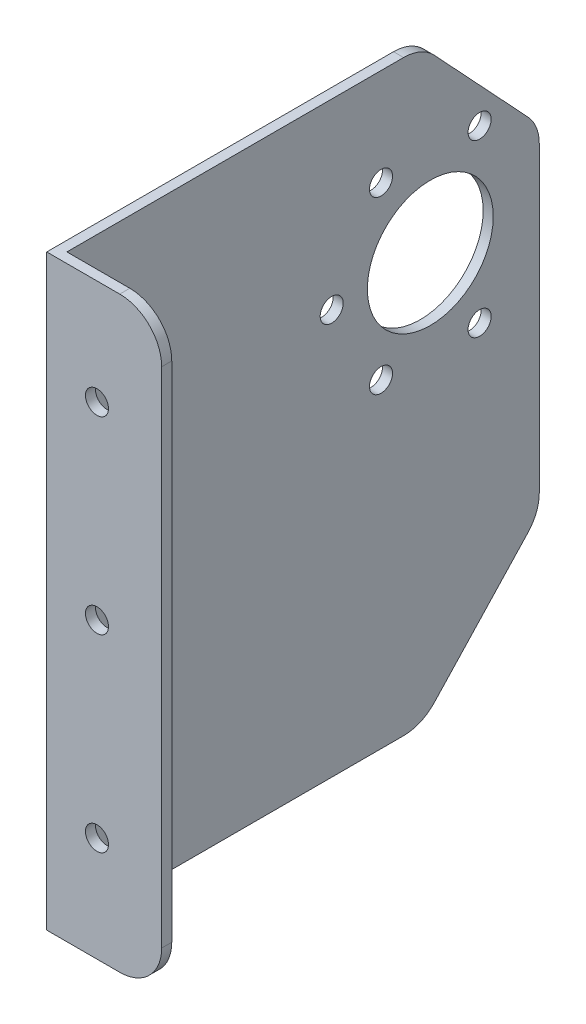
ISO-10303-21;
HEADER;
FILE_DESCRIPTION(('STEP AP214'),'2;1');
FILE_NAME('part.step','',(''),(''),'','','');
FILE_SCHEMA(('AUTOMOTIVE_DESIGN { 1 0 10303 214 1 1 1 1 }'));
ENDSEC;
DATA;
#1=APPLICATION_CONTEXT('core data for automotive mechanical design processes');
#2=APPLICATION_PROTOCOL_DEFINITION('international standard','automotive_design',2000,#1);
#3=PRODUCT_CONTEXT('',#1,'mechanical');
#4=PRODUCT('Part','Part','',(#3));
#5=PRODUCT_RELATED_PRODUCT_CATEGORY('part','',(#4));
#6=PRODUCT_DEFINITION_FORMATION('','',#4);
#7=PRODUCT_DEFINITION_CONTEXT('part definition',#1,'design');
#8=PRODUCT_DEFINITION('design','',#6,#7);
#9=PRODUCT_DEFINITION_SHAPE('','',#8);
#10=(LENGTH_UNIT() NAMED_UNIT(*) SI_UNIT(.MILLI.,.METRE.));
#11=(NAMED_UNIT(*) PLANE_ANGLE_UNIT() SI_UNIT($,.RADIAN.));
#12=(NAMED_UNIT(*) SI_UNIT($,.STERADIAN.) SOLID_ANGLE_UNIT());
#13=UNCERTAINTY_MEASURE_WITH_UNIT(LENGTH_MEASURE(1.E-05),#10,'distance_accuracy_value','');
#14=(GEOMETRIC_REPRESENTATION_CONTEXT(3) GLOBAL_UNCERTAINTY_ASSIGNED_CONTEXT((#13)) GLOBAL_UNIT_ASSIGNED_CONTEXT((#10,
#11,#12)) REPRESENTATION_CONTEXT('',''));
#15=CARTESIAN_POINT('',(0.,0.,0.));
#16=DIRECTION('',(0.,0.,1.));
#17=DIRECTION('',(1.,0.,0.));
#18=AXIS2_PLACEMENT_3D('',#15,#16,#17);
#19=CARTESIAN_POINT('',(2.4,0.,0.));
#20=DIRECTION('',(0.,0.,-1.));
#21=DIRECTION('',(0.,1.,0.));
#22=AXIS2_PLACEMENT_3D('',#19,#20,#21);
#23=PLANE('',#22);
#24=CARTESIAN_POINT('',(11.9749835807568,-115.,0.));
#25=DIRECTION('',(0.,0.,1.));
#26=DIRECTION('',(1.,0.,0.));
#27=AXIS2_PLACEMENT_3D('',#24,#25,#26);
#28=CIRCLE('',#27,2.75);
#29=CARTESIAN_POINT('',(14.7249835807568,-115.,0.));
#30=VERTEX_POINT('',#29);
#31=EDGE_CURVE('E572',#30,#30,#28,.T.);
#32=ORIENTED_EDGE('',*,*,#31,.F.);
#33=EDGE_LOOP('',(#32));
#34=FACE_BOUND('',#33,.T.);
#35=CARTESIAN_POINT('',(11.9749835807568,-25.,0.));
#36=DIRECTION('',(0.,0.,1.));
#37=DIRECTION('',(1.,0.,0.));
#38=AXIS2_PLACEMENT_3D('',#35,#36,#37);
#39=CIRCLE('',#38,2.75);
#40=CARTESIAN_POINT('',(14.7249835807568,-25.,0.));
#41=VERTEX_POINT('',#40);
#42=EDGE_CURVE('E573',#41,#41,#39,.T.);
#43=ORIENTED_EDGE('',*,*,#42,.F.);
#44=EDGE_LOOP('',(#43));
#45=FACE_BOUND('',#44,.T.);
#46=CARTESIAN_POINT('',(11.9749835807568,-70.,0.));
#47=DIRECTION('',(0.,0.,1.));
#48=DIRECTION('',(1.,0.,0.));
#49=AXIS2_PLACEMENT_3D('',#46,#47,#48);
#50=CIRCLE('',#49,2.75);
#51=CARTESIAN_POINT('',(14.7249835807568,-70.,0.));
#52=VERTEX_POINT('',#51);
#53=EDGE_CURVE('E258',#52,#52,#50,.T.);
#54=ORIENTED_EDGE('',*,*,#53,.F.);
#55=EDGE_LOOP('',(#54));
#56=FACE_BOUND('',#55,.T.);
#57=DIRECTION('',(-1.,0.,0.));
#58=VECTOR('',#57,1.);
#59=CARTESIAN_POINT('',(2.4,-140.,0.));
#60=LINE('',#59,#58);
#61=CARTESIAN_POINT('',(17.4,-140.,0.));
#62=VERTEX_POINT('',#61);
#63=CARTESIAN_POINT('',(0.,-140.,0.));
#64=VERTEX_POINT('',#63);
#65=EDGE_CURVE('E204',#62,#64,#60,.T.);
#66=ORIENTED_EDGE('',*,*,#65,.F.);
#67=CARTESIAN_POINT('',(17.4,-130.,0.));
#68=DIRECTION('',(0.,0.,-1.));
#69=DIRECTION('',(0.,1.,0.));
#70=AXIS2_PLACEMENT_3D('',#67,#68,#69);
#71=CIRCLE('',#70,10.);
#72=CARTESIAN_POINT('',(27.4,-130.,0.));
#73=VERTEX_POINT('',#72);
#74=EDGE_CURVE('E48',#62,#73,#71,.F.);
#75=ORIENTED_EDGE('',*,*,#74,.T.);
#76=DIRECTION('',(0.,-1.,0.));
#77=VECTOR('',#76,1.);
#78=CARTESIAN_POINT('',(27.4,-140.,0.));
#79=LINE('',#78,#77);
#80=CARTESIAN_POINT('',(27.4,-10.,0.));
#81=VERTEX_POINT('',#80);
#82=EDGE_CURVE('E167',#81,#73,#79,.T.);
#83=ORIENTED_EDGE('',*,*,#82,.F.);
#84=CARTESIAN_POINT('',(17.4,-10.,0.));
#85=DIRECTION('',(0.,0.,-1.));
#86=DIRECTION('',(0.,1.,0.));
#87=AXIS2_PLACEMENT_3D('',#84,#85,#86);
#88=CIRCLE('',#87,10.);
#89=CARTESIAN_POINT('',(17.4,0.,0.));
#90=VERTEX_POINT('',#89);
#91=EDGE_CURVE('E57',#81,#90,#88,.F.);
#92=ORIENTED_EDGE('',*,*,#91,.T.);
#93=DIRECTION('',(-1.,0.,0.));
#94=VECTOR('',#93,1.);
#95=CARTESIAN_POINT('',(2.4,0.,0.));
#96=LINE('',#95,#94);
#97=CARTESIAN_POINT('',(0.,0.,0.));
#98=VERTEX_POINT('',#97);
#99=EDGE_CURVE('E161',#90,#98,#96,.T.);
#100=ORIENTED_EDGE('',*,*,#99,.T.);
#101=DIRECTION('',(0.,-1.,0.));
#102=VECTOR('',#101,1.);
#103=CARTESIAN_POINT('',(0.,0.,0.));
#104=LINE('',#103,#102);
#105=EDGE_CURVE('E177',#98,#64,#104,.T.);
#106=ORIENTED_EDGE('',*,*,#105,.T.);
#107=EDGE_LOOP('',(#66,#75,#83,#92,#100,#106));
#108=FACE_BOUND('',#107,.T.);
#109=ADVANCED_FACE('F39',(#34,#45,#56,#108),#23,.F.);
#110=CARTESIAN_POINT('',(2.4,-140.,0.));
#111=DIRECTION('',(0.,1.,0.));
#112=DIRECTION('',(0.,0.,1.));
#113=AXIS2_PLACEMENT_3D('',#110,#111,#112);
#114=PLANE('',#113);
#115=DIRECTION('',(-1.,0.,0.));
#116=VECTOR('',#115,1.);
#117=CARTESIAN_POINT('',(27.4,-140.,-2.4));
#118=LINE('',#117,#116);
#119=CARTESIAN_POINT('',(17.4,-140.,-2.4));
#120=VERTEX_POINT('',#119);
#121=CARTESIAN_POINT('',(2.4,-140.,-2.4));
#122=VERTEX_POINT('',#121);
#123=EDGE_CURVE('E151',#120,#122,#118,.T.);
#124=ORIENTED_EDGE('',*,*,#123,.F.);
#125=DIRECTION('',(0.,0.,-1.));
#126=VECTOR('',#125,1.);
#127=CARTESIAN_POINT('',(17.4,-140.,0.));
#128=LINE('',#127,#126);
#129=EDGE_CURVE('E63',#120,#62,#128,.F.);
#130=ORIENTED_EDGE('',*,*,#129,.T.);
#131=ORIENTED_EDGE('',*,*,#65,.T.);
#132=DIRECTION('',(0.,0.,-1.));
#133=VECTOR('',#132,1.);
#134=CARTESIAN_POINT('',(0.,-140.,0.));
#135=LINE('',#134,#133);
#136=CARTESIAN_POINT('',(0.,-140.,-82.6544769808779));
#137=VERTEX_POINT('',#136);
#138=EDGE_CURVE('E194',#64,#137,#135,.T.);
#139=ORIENTED_EDGE('',*,*,#138,.T.);
#140=DIRECTION('',(1.,0.,0.));
#141=VECTOR('',#140,1.);
#142=CARTESIAN_POINT('',(2.4,-140.,-82.6544769808779));
#143=LINE('',#142,#141);
#144=CARTESIAN_POINT('',(2.4,-140.,-82.6544769808779));
#145=VERTEX_POINT('',#144);
#146=EDGE_CURVE('E206',#137,#145,#143,.T.);
#147=ORIENTED_EDGE('',*,*,#146,.T.);
#148=DIRECTION('',(0.,0.,-1.));
#149=VECTOR('',#148,1.);
#150=CARTESIAN_POINT('',(2.4,-140.,0.));
#151=LINE('',#150,#149);
#152=EDGE_CURVE('E189',#122,#145,#151,.T.);
#153=ORIENTED_EDGE('',*,*,#152,.F.);
#154=EDGE_LOOP('',(#124,#130,#131,#139,#147,#153));
#155=FACE_BOUND('',#154,.T.);
#156=ADVANCED_FACE('F278',(#155),#114,.F.);
#157=CARTESIAN_POINT('',(2.4,0.,-115.));
#158=DIRECTION('',(0.,0.,1.));
#159=DIRECTION('',(0.,-1.,0.));
#160=AXIS2_PLACEMENT_3D('',#157,#158,#159);
#161=PLANE('',#160);
#162=DIRECTION('',(0.,1.,0.));
#163=VECTOR('',#162,1.);
#164=CARTESIAN_POINT('',(2.4,0.,-115.));
#165=LINE('',#164,#163);
#166=CARTESIAN_POINT('',(2.4,-106.058368193798,-115.));
#167=VERTEX_POINT('',#166);
#168=CARTESIAN_POINT('',(2.4,-33.9416318062023,-115.));
#169=VERTEX_POINT('',#168);
#170=EDGE_CURVE('E165',#167,#169,#165,.T.);
#171=ORIENTED_EDGE('',*,*,#170,.F.);
#172=DIRECTION('',(1.,0.,0.));
#173=VECTOR('',#172,1.);
#174=CARTESIAN_POINT('',(2.4,-106.058368193798,-115.));
#175=LINE('',#174,#173);
#176=CARTESIAN_POINT('',(0.,-106.058368193798,-115.));
#177=VERTEX_POINT('',#176);
#178=EDGE_CURVE('E235',#167,#177,#175,.F.);
#179=ORIENTED_EDGE('',*,*,#178,.T.);
#180=DIRECTION('',(0.,1.,0.));
#181=VECTOR('',#180,1.);
#182=CARTESIAN_POINT('',(0.,0.,-115.));
#183=LINE('',#182,#181);
#184=CARTESIAN_POINT('',(0.,-33.9416318062023,-115.));
#185=VERTEX_POINT('',#184);
#186=EDGE_CURVE('E196',#177,#185,#183,.T.);
#187=ORIENTED_EDGE('',*,*,#186,.T.);
#188=DIRECTION('',(1.,0.,0.));
#189=VECTOR('',#188,1.);
#190=CARTESIAN_POINT('',(2.4,-33.9416318062023,-115.));
#191=LINE('',#190,#189);
#192=EDGE_CURVE('E228',#185,#169,#191,.T.);
#193=ORIENTED_EDGE('',*,*,#192,.T.);
#194=EDGE_LOOP('',(#171,#179,#187,#193));
#195=FACE_BOUND('',#194,.T.);
#196=ADVANCED_FACE('F288',(#195),#161,.F.);
#197=CARTESIAN_POINT('',(2.4,0.,0.));
#198=DIRECTION('',(0.,-1.,0.));
#199=DIRECTION('',(0.,0.,-1.));
#200=AXIS2_PLACEMENT_3D('',#197,#198,#199);
#201=PLANE('',#200);
#202=ORIENTED_EDGE('',*,*,#99,.F.);
#203=DIRECTION('',(0.,0.,1.));
#204=VECTOR('',#203,1.);
#205=CARTESIAN_POINT('',(17.4,0.,0.));
#206=LINE('',#205,#204);
#207=CARTESIAN_POINT('',(17.4,0.,-2.4));
#208=VERTEX_POINT('',#207);
#209=EDGE_CURVE('E11',#90,#208,#206,.F.);
#210=ORIENTED_EDGE('',*,*,#209,.T.);
#211=DIRECTION('',(-1.,0.,0.));
#212=VECTOR('',#211,1.);
#213=CARTESIAN_POINT('',(27.4,0.,-2.4));
#214=LINE('',#213,#212);
#215=CARTESIAN_POINT('',(2.4,0.,-2.4));
#216=VERTEX_POINT('',#215);
#217=EDGE_CURVE('E142',#208,#216,#214,.T.);
#218=ORIENTED_EDGE('',*,*,#217,.T.);
#219=DIRECTION('',(0.,0.,1.));
#220=VECTOR('',#219,1.);
#221=CARTESIAN_POINT('',(2.4,0.,0.));
#222=LINE('',#221,#220);
#223=CARTESIAN_POINT('',(2.4,0.,-82.6544769808779));
#224=VERTEX_POINT('',#223);
#225=EDGE_CURVE('E144',#224,#216,#222,.T.);
#226=ORIENTED_EDGE('',*,*,#225,.F.);
#227=DIRECTION('',(1.,0.,0.));
#228=VECTOR('',#227,1.);
#229=CARTESIAN_POINT('',(2.4,0.,-82.6544769808779));
#230=LINE('',#229,#228);
#231=CARTESIAN_POINT('',(0.,0.,-82.6544769808779));
#232=VERTEX_POINT('',#231);
#233=EDGE_CURVE('E239',#224,#232,#230,.F.);
#234=ORIENTED_EDGE('',*,*,#233,.T.);
#235=DIRECTION('',(0.,0.,1.));
#236=VECTOR('',#235,1.);
#237=CARTESIAN_POINT('',(0.,0.,0.));
#238=LINE('',#237,#236);
#239=EDGE_CURVE('E190',#232,#98,#238,.T.);
#240=ORIENTED_EDGE('',*,*,#239,.T.);
#241=EDGE_LOOP('',(#202,#210,#218,#226,#234,#240));
#242=FACE_BOUND('',#241,.T.);
#243=ADVANCED_FACE('F145',(#242),#201,.F.);
#244=CARTESIAN_POINT('',(2.4,0.,0.));
#245=DIRECTION('',(1.,0.,0.));
#246=DIRECTION('',(0.,0.,-1.));
#247=AXIS2_PLACEMENT_3D('',#244,#245,#246);
#248=PLANE('',#247);
#249=CARTESIAN_POINT('',(2.4,-23.1543738118279,-77.277947803544));
#250=DIRECTION('',(1.,0.,0.));
#251=DIRECTION('',(0.,0.,-1.));
#252=AXIS2_PLACEMENT_3D('',#249,#250,#251);
#253=CIRCLE('',#252,2.75);
#254=CARTESIAN_POINT('',(2.4,-23.1543738118279,-80.027947803544));
#255=VERTEX_POINT('',#254);
#256=EDGE_CURVE('E541',#255,#255,#253,.T.);
#257=ORIENTED_EDGE('',*,*,#256,.F.);
#258=EDGE_LOOP('',(#257));
#259=FACE_BOUND('',#258,.T.);
#260=CARTESIAN_POINT('',(2.4,-23.1543738118279,-100.777947803544));
#261=DIRECTION('',(1.,0.,0.));
#262=DIRECTION('',(0.,0.,-1.));
#263=AXIS2_PLACEMENT_3D('',#260,#261,#262);
#264=CIRCLE('',#263,2.75000000000001);
#265=CARTESIAN_POINT('',(2.4,-23.1543738118279,-103.527947803544));
#266=VERTEX_POINT('',#265);
#267=EDGE_CURVE('E550',#266,#266,#264,.T.);
#268=ORIENTED_EDGE('',*,*,#267,.F.);
#269=EDGE_LOOP('',(#268));
#270=FACE_BOUND('',#269,.T.);
#271=CARTESIAN_POINT('',(2.4,-43.5059708007622,-65.527947803544));
#272=DIRECTION('',(1.,0.,0.));
#273=DIRECTION('',(0.,0.,-1.));
#274=AXIS2_PLACEMENT_3D('',#271,#272,#273);
#275=CIRCLE('',#274,2.74999999999999);
#276=CARTESIAN_POINT('',(2.4,-43.5059708007622,-68.277947803544));
#277=VERTEX_POINT('',#276);
#278=EDGE_CURVE('E559',#277,#277,#275,.T.);
#279=ORIENTED_EDGE('',*,*,#278,.F.);
#280=EDGE_LOOP('',(#279));
#281=FACE_BOUND('',#280,.T.);
#282=CARTESIAN_POINT('',(2.4,-63.8575677896965,-77.2779478035441));
#283=DIRECTION('',(1.,0.,0.));
#284=DIRECTION('',(0.,0.,-1.));
#285=AXIS2_PLACEMENT_3D('',#282,#283,#284);
#286=CIRCLE('',#285,2.75000000000001);
#287=CARTESIAN_POINT('',(2.4,-63.8575677896965,-80.0279478035441));
#288=VERTEX_POINT('',#287);
#289=EDGE_CURVE('E562',#288,#288,#286,.T.);
#290=ORIENTED_EDGE('',*,*,#289,.F.);
#291=EDGE_LOOP('',(#290));
#292=FACE_BOUND('',#291,.T.);
#293=CARTESIAN_POINT('',(2.4,-63.8575677896965,-100.777947803544));
#294=DIRECTION('',(1.,0.,0.));
#295=DIRECTION('',(0.,0.,-1.));
#296=AXIS2_PLACEMENT_3D('',#293,#294,#295);
#297=CIRCLE('',#296,2.75);
#298=CARTESIAN_POINT('',(2.4,-63.8575677896965,-103.527947803544));
#299=VERTEX_POINT('',#298);
#300=EDGE_CURVE('E568',#299,#299,#297,.T.);
#301=ORIENTED_EDGE('',*,*,#300,.F.);
#302=EDGE_LOOP('',(#301));
#303=FACE_BOUND('',#302,.T.);
#304=CARTESIAN_POINT('',(2.4,-43.5059708007621,-89.0279478035438));
#305=DIRECTION('',(1.,0.,0.));
#306=DIRECTION('',(0.,0.,-1.));
#307=AXIS2_PLACEMENT_3D('',#304,#305,#306);
#308=CIRCLE('',#307,15.);
#309=CARTESIAN_POINT('',(2.4,-43.5059708007621,-104.027947803544));
#310=VERTEX_POINT('',#309);
#311=EDGE_CURVE('E545',#310,#310,#308,.T.);
#312=ORIENTED_EDGE('',*,*,#311,.F.);
#313=EDGE_LOOP('',(#312));
#314=FACE_BOUND('',#313,.T.);
#315=DIRECTION('',(0.,1.,0.));
#316=VECTOR('',#315,1.);
#317=CARTESIAN_POINT('',(2.4,-140.,-2.4));
#318=LINE('',#317,#316);
#319=EDGE_CURVE('E160',#122,#216,#318,.T.);
#320=ORIENTED_EDGE('',*,*,#319,.F.);
#321=ORIENTED_EDGE('',*,*,#152,.T.);
#322=CARTESIAN_POINT('',(2.4,-130.,-82.6544769808779));
#323=DIRECTION('',(1.,0.,0.));
#324=DIRECTION('',(0.,0.,-1.));
#325=AXIS2_PLACEMENT_3D('',#322,#323,#324);
#326=CIRCLE('',#325,10.);
#327=CARTESIAN_POINT('',(2.4,-136.8231825036,-89.9650296633066));
#328=VERTEX_POINT('',#327);
#329=EDGE_CURVE('E212',#145,#328,#326,.T.);
#330=ORIENTED_EDGE('',*,*,#329,.T.);
#331=DIRECTION('',(0.,-0.731055268242869,0.682318250360011));
#332=VECTOR('',#331,1.);
#333=CARTESIAN_POINT('',(2.4,-110.,-115.));
#334=LINE('',#333,#332);
#335=CARTESIAN_POINT('',(2.4,-112.881550697398,-112.310552682429));
#336=VERTEX_POINT('',#335);
#337=EDGE_CURVE('E181',#336,#328,#334,.T.);
#338=ORIENTED_EDGE('',*,*,#337,.F.);
#339=CARTESIAN_POINT('',(2.4,-106.058368193798,-105.));
#340=DIRECTION('',(1.,0.,0.));
#341=DIRECTION('',(0.,0.,-1.));
#342=AXIS2_PLACEMENT_3D('',#339,#340,#341);
#343=CIRCLE('',#342,10.);
#344=EDGE_CURVE('E215',#336,#167,#343,.T.);
#345=ORIENTED_EDGE('',*,*,#344,.T.);
#346=ORIENTED_EDGE('',*,*,#170,.T.);
#347=CARTESIAN_POINT('',(2.4,-33.9416318062023,-105.));
#348=DIRECTION('',(1.,0.,0.));
#349=DIRECTION('',(0.,0.,-1.));
#350=AXIS2_PLACEMENT_3D('',#347,#348,#349);
#351=CIRCLE('',#350,10.);
#352=CARTESIAN_POINT('',(2.4,-27.1184493026022,-112.310552682429));
#353=VERTEX_POINT('',#352);
#354=EDGE_CURVE('E209',#169,#353,#351,.T.);
#355=ORIENTED_EDGE('',*,*,#354,.T.);
#356=DIRECTION('',(0.,-0.731055268242869,-0.682318250360012));
#357=VECTOR('',#356,1.);
#358=CARTESIAN_POINT('',(2.4,0.,-87.));
#359=LINE('',#358,#357);
#360=CARTESIAN_POINT('',(2.4,-3.17681749639988,-89.9650296633066));
#361=VERTEX_POINT('',#360);
#362=EDGE_CURVE('E179',#361,#353,#359,.T.);
#363=ORIENTED_EDGE('',*,*,#362,.F.);
#364=CARTESIAN_POINT('',(2.4,-10.,-82.6544769808779));
#365=DIRECTION('',(1.,0.,0.));
#366=DIRECTION('',(0.,0.,-1.));
#367=AXIS2_PLACEMENT_3D('',#364,#365,#366);
#368=CIRCLE('',#367,10.);
#369=EDGE_CURVE('E159',#361,#224,#368,.T.);
#370=ORIENTED_EDGE('',*,*,#369,.T.);
#371=ORIENTED_EDGE('',*,*,#225,.T.);
#372=EDGE_LOOP('',(#320,#321,#330,#338,#345,#346,#355,#363,#370,#371));
#373=FACE_BOUND('',#372,.T.);
#374=ADVANCED_FACE('F156',(#259,#270,#281,#292,#303,#314,#373),#248,.T.);
#375=CARTESIAN_POINT('',(0.,0.,0.));
#376=DIRECTION('',(1.,0.,0.));
#377=DIRECTION('',(0.,0.,-1.));
#378=AXIS2_PLACEMENT_3D('',#375,#376,#377);
#379=PLANE('',#378);
#380=CARTESIAN_POINT('',(0.,-23.1543738118279,-77.277947803544));
#381=DIRECTION('',(1.,0.,0.));
#382=DIRECTION('',(0.,0.,-1.));
#383=AXIS2_PLACEMENT_3D('',#380,#381,#382);
#384=CIRCLE('',#383,2.75);
#385=CARTESIAN_POINT('',(0.,-23.1543738118279,-80.027947803544));
#386=VERTEX_POINT('',#385);
#387=EDGE_CURVE('E538',#386,#386,#384,.T.);
#388=ORIENTED_EDGE('',*,*,#387,.T.);
#389=EDGE_LOOP('',(#388));
#390=FACE_BOUND('',#389,.T.);
#391=CARTESIAN_POINT('',(0.,-23.1543738118279,-100.777947803544));
#392=DIRECTION('',(1.,0.,0.));
#393=DIRECTION('',(0.,0.,-1.));
#394=AXIS2_PLACEMENT_3D('',#391,#392,#393);
#395=CIRCLE('',#394,2.75000000000001);
#396=CARTESIAN_POINT('',(0.,-23.1543738118279,-103.527947803544));
#397=VERTEX_POINT('',#396);
#398=EDGE_CURVE('E553',#397,#397,#395,.T.);
#399=ORIENTED_EDGE('',*,*,#398,.T.);
#400=EDGE_LOOP('',(#399));
#401=FACE_BOUND('',#400,.T.);
#402=CARTESIAN_POINT('',(0.,-43.5059708007622,-65.527947803544));
#403=DIRECTION('',(1.,0.,0.));
#404=DIRECTION('',(0.,0.,-1.));
#405=AXIS2_PLACEMENT_3D('',#402,#403,#404);
#406=CIRCLE('',#405,2.74999999999999);
#407=CARTESIAN_POINT('',(0.,-43.5059708007622,-68.277947803544));
#408=VERTEX_POINT('',#407);
#409=EDGE_CURVE('E561',#408,#408,#406,.T.);
#410=ORIENTED_EDGE('',*,*,#409,.T.);
#411=EDGE_LOOP('',(#410));
#412=FACE_BOUND('',#411,.T.);
#413=CARTESIAN_POINT('',(0.,-63.8575677896965,-77.2779478035441));
#414=DIRECTION('',(1.,0.,0.));
#415=DIRECTION('',(0.,0.,-1.));
#416=AXIS2_PLACEMENT_3D('',#413,#414,#415);
#417=CIRCLE('',#416,2.75000000000001);
#418=CARTESIAN_POINT('',(0.,-63.8575677896965,-80.0279478035441));
#419=VERTEX_POINT('',#418);
#420=EDGE_CURVE('E570',#419,#419,#417,.T.);
#421=ORIENTED_EDGE('',*,*,#420,.T.);
#422=EDGE_LOOP('',(#421));
#423=FACE_BOUND('',#422,.T.);
#424=CARTESIAN_POINT('',(0.,-63.8575677896965,-100.777947803544));
#425=DIRECTION('',(1.,0.,0.));
#426=DIRECTION('',(0.,0.,-1.));
#427=AXIS2_PLACEMENT_3D('',#424,#425,#426);
#428=CIRCLE('',#427,2.75);
#429=CARTESIAN_POINT('',(0.,-63.8575677896965,-103.527947803544));
#430=VERTEX_POINT('',#429);
#431=EDGE_CURVE('E549',#430,#430,#428,.T.);
#432=ORIENTED_EDGE('',*,*,#431,.T.);
#433=EDGE_LOOP('',(#432));
#434=FACE_BOUND('',#433,.T.);
#435=CARTESIAN_POINT('',(0.,-43.5059708007621,-89.0279478035438));
#436=DIRECTION('',(1.,0.,0.));
#437=DIRECTION('',(0.,0.,-1.));
#438=AXIS2_PLACEMENT_3D('',#435,#436,#437);
#439=CIRCLE('',#438,15.);
#440=CARTESIAN_POINT('',(0.,-43.5059708007621,-104.027947803544));
#441=VERTEX_POINT('',#440);
#442=EDGE_CURVE('E544',#441,#441,#439,.T.);
#443=ORIENTED_EDGE('',*,*,#442,.T.);
#444=EDGE_LOOP('',(#443));
#445=FACE_BOUND('',#444,.T.);
#446=DIRECTION('',(0.,-0.731055268242869,0.682318250360011));
#447=VECTOR('',#446,1.);
#448=CARTESIAN_POINT('',(0.,-110.,-115.));
#449=LINE('',#448,#447);
#450=CARTESIAN_POINT('',(0.,-112.881550697398,-112.310552682429));
#451=VERTEX_POINT('',#450);
#452=CARTESIAN_POINT('',(0.,-136.8231825036,-89.9650296633066));
#453=VERTEX_POINT('',#452);
#454=EDGE_CURVE('E175',#451,#453,#449,.T.);
#455=ORIENTED_EDGE('',*,*,#454,.T.);
#456=CARTESIAN_POINT('',(0.,-130.,-82.6544769808779));
#457=DIRECTION('',(1.,0.,0.));
#458=DIRECTION('',(0.,0.,-1.));
#459=AXIS2_PLACEMENT_3D('',#456,#457,#458);
#460=CIRCLE('',#459,10.);
#461=EDGE_CURVE('E227',#453,#137,#460,.F.);
#462=ORIENTED_EDGE('',*,*,#461,.T.);
#463=ORIENTED_EDGE('',*,*,#138,.F.);
#464=ORIENTED_EDGE('',*,*,#105,.F.);
#465=ORIENTED_EDGE('',*,*,#239,.F.);
#466=CARTESIAN_POINT('',(0.,-10.,-82.6544769808779));
#467=DIRECTION('',(1.,0.,0.));
#468=DIRECTION('',(0.,0.,-1.));
#469=AXIS2_PLACEMENT_3D('',#466,#467,#468);
#470=CIRCLE('',#469,10.);
#471=CARTESIAN_POINT('',(0.,-3.17681749639988,-89.9650296633066));
#472=VERTEX_POINT('',#471);
#473=EDGE_CURVE('E222',#232,#472,#470,.F.);
#474=ORIENTED_EDGE('',*,*,#473,.T.);
#475=DIRECTION('',(0.,-0.731055268242869,-0.682318250360012));
#476=VECTOR('',#475,1.);
#477=CARTESIAN_POINT('',(0.,0.,-87.));
#478=LINE('',#477,#476);
#479=CARTESIAN_POINT('',(0.,-27.1184493026022,-112.310552682429));
#480=VERTEX_POINT('',#479);
#481=EDGE_CURVE('E176',#472,#480,#478,.T.);
#482=ORIENTED_EDGE('',*,*,#481,.T.);
#483=CARTESIAN_POINT('',(0.,-33.9416318062023,-105.));
#484=DIRECTION('',(1.,0.,0.));
#485=DIRECTION('',(0.,0.,-1.));
#486=AXIS2_PLACEMENT_3D('',#483,#484,#485);
#487=CIRCLE('',#486,10.);
#488=EDGE_CURVE('E224',#480,#185,#487,.F.);
#489=ORIENTED_EDGE('',*,*,#488,.T.);
#490=ORIENTED_EDGE('',*,*,#186,.F.);
#491=CARTESIAN_POINT('',(0.,-106.058368193798,-105.));
#492=DIRECTION('',(1.,0.,0.));
#493=DIRECTION('',(0.,0.,-1.));
#494=AXIS2_PLACEMENT_3D('',#491,#492,#493);
#495=CIRCLE('',#494,10.);
#496=EDGE_CURVE('E223',#177,#451,#495,.F.);
#497=ORIENTED_EDGE('',*,*,#496,.T.);
#498=EDGE_LOOP('',(#455,#462,#463,#464,#465,#474,#482,#489,#490,#497));
#499=FACE_BOUND('',#498,.T.);
#500=ADVANCED_FACE('F334',(#390,#401,#412,#423,#434,#445,#499),#379,.F.);
#501=CARTESIAN_POINT('',(0.,0.,-87.));
#502=DIRECTION('',(0.,-0.682318250360011,0.731055268242869));
#503=DIRECTION('',(0.,-0.731055268242869,-0.682318250360012));
#504=AXIS2_PLACEMENT_3D('',#501,#502,#503);
#505=PLANE('',#504);
#506=ORIENTED_EDGE('',*,*,#362,.T.);
#507=DIRECTION('',(1.,0.,0.));
#508=VECTOR('',#507,1.);
#509=CARTESIAN_POINT('',(0.,-27.1184493026021,-112.310552682429));
#510=LINE('',#509,#508);
#511=EDGE_CURVE('E240',#353,#480,#510,.F.);
#512=ORIENTED_EDGE('',*,*,#511,.T.);
#513=ORIENTED_EDGE('',*,*,#481,.F.);
#514=DIRECTION('',(1.,0.,0.));
#515=VECTOR('',#514,1.);
#516=CARTESIAN_POINT('',(0.,-3.17681749639988,-89.9650296633066));
#517=LINE('',#516,#515);
#518=EDGE_CURVE('E232',#472,#361,#517,.T.);
#519=ORIENTED_EDGE('',*,*,#518,.T.);
#520=EDGE_LOOP('',(#506,#512,#513,#519));
#521=FACE_BOUND('',#520,.T.);
#522=ADVANCED_FACE('F342',(#521),#505,.F.);
#523=CARTESIAN_POINT('',(0.,-110.,-115.));
#524=DIRECTION('',(0.,0.682318250360011,0.731055268242869));
#525=DIRECTION('',(0.,-0.731055268242869,0.682318250360011));
#526=AXIS2_PLACEMENT_3D('',#523,#524,#525);
#527=PLANE('',#526);
#528=ORIENTED_EDGE('',*,*,#337,.T.);
#529=DIRECTION('',(1.,0.,0.));
#530=VECTOR('',#529,1.);
#531=CARTESIAN_POINT('',(0.,-136.8231825036,-89.9650296633066));
#532=LINE('',#531,#530);
#533=EDGE_CURVE('E218',#328,#453,#532,.F.);
#534=ORIENTED_EDGE('',*,*,#533,.T.);
#535=ORIENTED_EDGE('',*,*,#454,.F.);
#536=DIRECTION('',(1.,0.,0.));
#537=VECTOR('',#536,1.);
#538=CARTESIAN_POINT('',(0.,-112.881550697398,-112.310552682429));
#539=LINE('',#538,#537);
#540=EDGE_CURVE('E216',#451,#336,#539,.T.);
#541=ORIENTED_EDGE('',*,*,#540,.T.);
#542=EDGE_LOOP('',(#528,#534,#535,#541));
#543=FACE_BOUND('',#542,.T.);
#544=ADVANCED_FACE('F299',(#543),#527,.F.);
#545=CARTESIAN_POINT('',(2.4,-130.,-82.6544769808779));
#546=DIRECTION('',(1.,0.,0.));
#547=DIRECTION('',(0.,0.,-1.));
#548=AXIS2_PLACEMENT_3D('',#545,#546,#547);
#549=CYLINDRICAL_SURFACE('',#548,10.);
#550=ORIENTED_EDGE('',*,*,#461,.F.);
#551=ORIENTED_EDGE('',*,*,#533,.F.);
#552=ORIENTED_EDGE('',*,*,#329,.F.);
#553=ORIENTED_EDGE('',*,*,#146,.F.);
#554=EDGE_LOOP('',(#550,#551,#552,#553));
#555=FACE_BOUND('',#554,.T.);
#556=ADVANCED_FACE('F294',(#555),#549,.T.);
#557=CARTESIAN_POINT('',(0.,-106.058368193798,-105.));
#558=DIRECTION('',(1.,0.,0.));
#559=DIRECTION('',(0.,0.,-1.));
#560=AXIS2_PLACEMENT_3D('',#557,#558,#559);
#561=CYLINDRICAL_SURFACE('',#560,10.);
#562=ORIENTED_EDGE('',*,*,#496,.F.);
#563=ORIENTED_EDGE('',*,*,#178,.F.);
#564=ORIENTED_EDGE('',*,*,#344,.F.);
#565=ORIENTED_EDGE('',*,*,#540,.F.);
#566=EDGE_LOOP('',(#562,#563,#564,#565));
#567=FACE_BOUND('',#566,.T.);
#568=ADVANCED_FACE('F297',(#567),#561,.T.);
#569=CARTESIAN_POINT('',(2.4,-33.9416318062023,-105.));
#570=DIRECTION('',(1.,0.,0.));
#571=DIRECTION('',(0.,0.,-1.));
#572=AXIS2_PLACEMENT_3D('',#569,#570,#571);
#573=CYLINDRICAL_SURFACE('',#572,10.);
#574=ORIENTED_EDGE('',*,*,#488,.F.);
#575=ORIENTED_EDGE('',*,*,#511,.F.);
#576=ORIENTED_EDGE('',*,*,#354,.F.);
#577=ORIENTED_EDGE('',*,*,#192,.F.);
#578=EDGE_LOOP('',(#574,#575,#576,#577));
#579=FACE_BOUND('',#578,.T.);
#580=ADVANCED_FACE('F305',(#579),#573,.T.);
#581=CARTESIAN_POINT('',(0.,-10.,-82.6544769808779));
#582=DIRECTION('',(1.,0.,0.));
#583=DIRECTION('',(0.,0.,-1.));
#584=AXIS2_PLACEMENT_3D('',#581,#582,#583);
#585=CYLINDRICAL_SURFACE('',#584,10.);
#586=ORIENTED_EDGE('',*,*,#473,.F.);
#587=ORIENTED_EDGE('',*,*,#233,.F.);
#588=ORIENTED_EDGE('',*,*,#369,.F.);
#589=ORIENTED_EDGE('',*,*,#518,.F.);
#590=EDGE_LOOP('',(#586,#587,#588,#589));
#591=FACE_BOUND('',#590,.T.);
#592=ADVANCED_FACE('F308',(#591),#585,.T.);
#593=CARTESIAN_POINT('',(27.4,-140.,-2.4));
#594=DIRECTION('',(0.,0.,1.));
#595=DIRECTION('',(1.,0.,0.));
#596=AXIS2_PLACEMENT_3D('',#593,#594,#595);
#597=PLANE('',#596);
#598=CARTESIAN_POINT('',(11.9749835807568,-115.,-2.4));
#599=DIRECTION('',(0.,0.,1.));
#600=DIRECTION('',(1.,0.,0.));
#601=AXIS2_PLACEMENT_3D('',#598,#599,#600);
#602=CIRCLE('',#601,2.75);
#603=CARTESIAN_POINT('',(14.7249835807568,-115.,-2.4));
#604=VERTEX_POINT('',#603);
#605=EDGE_CURVE('E43',#604,#604,#602,.T.);
#606=ORIENTED_EDGE('',*,*,#605,.T.);
#607=EDGE_LOOP('',(#606));
#608=FACE_BOUND('',#607,.T.);
#609=CARTESIAN_POINT('',(11.9749835807568,-25.,-2.4));
#610=DIRECTION('',(0.,0.,1.));
#611=DIRECTION('',(1.,0.,0.));
#612=AXIS2_PLACEMENT_3D('',#609,#610,#611);
#613=CIRCLE('',#612,2.75);
#614=CARTESIAN_POINT('',(14.7249835807568,-25.,-2.4));
#615=VERTEX_POINT('',#614);
#616=EDGE_CURVE('E171',#615,#615,#613,.T.);
#617=ORIENTED_EDGE('',*,*,#616,.T.);
#618=EDGE_LOOP('',(#617));
#619=FACE_BOUND('',#618,.T.);
#620=CARTESIAN_POINT('',(11.9749835807568,-70.,-2.4));
#621=DIRECTION('',(0.,0.,1.));
#622=DIRECTION('',(1.,0.,0.));
#623=AXIS2_PLACEMENT_3D('',#620,#621,#622);
#624=CIRCLE('',#623,2.75);
#625=CARTESIAN_POINT('',(14.7249835807568,-70.,-2.4));
#626=VERTEX_POINT('',#625);
#627=EDGE_CURVE('E255',#626,#626,#624,.T.);
#628=ORIENTED_EDGE('',*,*,#627,.T.);
#629=EDGE_LOOP('',(#628));
#630=FACE_BOUND('',#629,.T.);
#631=DIRECTION('',(0.,1.,0.));
#632=VECTOR('',#631,1.);
#633=CARTESIAN_POINT('',(27.4,-140.,-2.4));
#634=LINE('',#633,#632);
#635=CARTESIAN_POINT('',(27.4,-130.,-2.4));
#636=VERTEX_POINT('',#635);
#637=CARTESIAN_POINT('',(27.4,-10.,-2.4));
#638=VERTEX_POINT('',#637);
#639=EDGE_CURVE('E155',#636,#638,#634,.T.);
#640=ORIENTED_EDGE('',*,*,#639,.F.);
#641=CARTESIAN_POINT('',(17.4,-130.,-2.4));
#642=DIRECTION('',(0.,0.,1.));
#643=DIRECTION('',(1.,0.,0.));
#644=AXIS2_PLACEMENT_3D('',#641,#642,#643);
#645=CIRCLE('',#644,10.);
#646=EDGE_CURVE('E247',#636,#120,#645,.F.);
#647=ORIENTED_EDGE('',*,*,#646,.T.);
#648=ORIENTED_EDGE('',*,*,#123,.T.);
#649=ORIENTED_EDGE('',*,*,#319,.T.);
#650=ORIENTED_EDGE('',*,*,#217,.F.);
#651=CARTESIAN_POINT('',(17.4,-10.,-2.4));
#652=DIRECTION('',(0.,0.,1.));
#653=DIRECTION('',(1.,0.,0.));
#654=AXIS2_PLACEMENT_3D('',#651,#652,#653);
#655=CIRCLE('',#654,10.);
#656=EDGE_CURVE('E250',#208,#638,#655,.F.);
#657=ORIENTED_EDGE('',*,*,#656,.T.);
#658=EDGE_LOOP('',(#640,#647,#648,#649,#650,#657));
#659=FACE_BOUND('',#658,.T.);
#660=ADVANCED_FACE('F164',(#608,#619,#630,#659),#597,.F.);
#661=CARTESIAN_POINT('',(27.4,0.,0.));
#662=DIRECTION('',(-1.,0.,0.));
#663=DIRECTION('',(0.,0.,1.));
#664=AXIS2_PLACEMENT_3D('',#661,#662,#663);
#665=PLANE('',#664);
#666=ORIENTED_EDGE('',*,*,#82,.T.);
#667=DIRECTION('',(0.,0.,-1.));
#668=VECTOR('',#667,1.);
#669=CARTESIAN_POINT('',(27.4,-130.,0.));
#670=LINE('',#669,#668);
#671=EDGE_CURVE('E243',#73,#636,#670,.T.);
#672=ORIENTED_EDGE('',*,*,#671,.T.);
#673=ORIENTED_EDGE('',*,*,#639,.T.);
#674=DIRECTION('',(0.,0.,1.));
#675=VECTOR('',#674,1.);
#676=CARTESIAN_POINT('',(27.4,-10.,0.));
#677=LINE('',#676,#675);
#678=EDGE_CURVE('E241',#638,#81,#677,.T.);
#679=ORIENTED_EDGE('',*,*,#678,.T.);
#680=EDGE_LOOP('',(#666,#672,#673,#679));
#681=FACE_BOUND('',#680,.T.);
#682=ADVANCED_FACE('F315',(#681),#665,.F.);
#683=CARTESIAN_POINT('',(17.4,-130.,0.));
#684=DIRECTION('',(0.,0.,-1.));
#685=DIRECTION('',(-1.,0.,0.));
#686=AXIS2_PLACEMENT_3D('',#683,#684,#685);
#687=CYLINDRICAL_SURFACE('',#686,10.);
#688=ORIENTED_EDGE('',*,*,#74,.F.);
#689=ORIENTED_EDGE('',*,*,#129,.F.);
#690=ORIENTED_EDGE('',*,*,#646,.F.);
#691=ORIENTED_EDGE('',*,*,#671,.F.);
#692=EDGE_LOOP('',(#688,#689,#690,#691));
#693=FACE_BOUND('',#692,.T.);
#694=ADVANCED_FACE('F309',(#693),#687,.T.);
#695=CARTESIAN_POINT('',(17.4,-10.,0.));
#696=DIRECTION('',(0.,0.,1.));
#697=DIRECTION('',(1.,0.,0.));
#698=AXIS2_PLACEMENT_3D('',#695,#696,#697);
#699=CYLINDRICAL_SURFACE('',#698,10.);
#700=ORIENTED_EDGE('',*,*,#656,.F.);
#701=ORIENTED_EDGE('',*,*,#209,.F.);
#702=ORIENTED_EDGE('',*,*,#91,.F.);
#703=ORIENTED_EDGE('',*,*,#678,.F.);
#704=EDGE_LOOP('',(#700,#701,#702,#703));
#705=FACE_BOUND('',#704,.T.);
#706=ADVANCED_FACE('F41',(#705),#699,.T.);
#707=CARTESIAN_POINT('',(11.9749835807568,-70.,-115.));
#708=DIRECTION('',(0.,0.,1.));
#709=DIRECTION('',(1.,0.,0.));
#710=AXIS2_PLACEMENT_3D('',#707,#708,#709);
#711=CYLINDRICAL_SURFACE('',#710,2.75);
#712=ORIENTED_EDGE('',*,*,#53,.T.);
#713=EDGE_LOOP('',(#712));
#714=FACE_BOUND('',#713,.T.);
#715=ORIENTED_EDGE('',*,*,#627,.F.);
#716=EDGE_LOOP('',(#715));
#717=FACE_BOUND('',#716,.T.);
#718=ADVANCED_FACE('F264',(#714,#717),#711,.F.);
#719=CARTESIAN_POINT('',(11.9749835807568,-25.,-115.));
#720=DIRECTION('',(0.,0.,1.));
#721=DIRECTION('',(1.,0.,0.));
#722=AXIS2_PLACEMENT_3D('',#719,#720,#721);
#723=CYLINDRICAL_SURFACE('',#722,2.75);
#724=ORIENTED_EDGE('',*,*,#42,.T.);
#725=EDGE_LOOP('',(#724));
#726=FACE_BOUND('',#725,.T.);
#727=ORIENTED_EDGE('',*,*,#616,.F.);
#728=EDGE_LOOP('',(#727));
#729=FACE_BOUND('',#728,.T.);
#730=ADVANCED_FACE('F265',(#726,#729),#723,.F.);
#731=CARTESIAN_POINT('',(11.9749835807568,-115.,-115.));
#732=DIRECTION('',(0.,0.,1.));
#733=DIRECTION('',(1.,0.,0.));
#734=AXIS2_PLACEMENT_3D('',#731,#732,#733);
#735=CYLINDRICAL_SURFACE('',#734,2.75);
#736=ORIENTED_EDGE('',*,*,#31,.T.);
#737=EDGE_LOOP('',(#736));
#738=FACE_BOUND('',#737,.T.);
#739=ORIENTED_EDGE('',*,*,#605,.F.);
#740=EDGE_LOOP('',(#739));
#741=FACE_BOUND('',#740,.T.);
#742=ADVANCED_FACE('F262',(#738,#741),#735,.F.);
#743=CARTESIAN_POINT('',(0.,-43.5059708007621,-89.0279478035438));
#744=DIRECTION('',(1.,0.,0.));
#745=DIRECTION('',(0.,0.,-1.));
#746=AXIS2_PLACEMENT_3D('',#743,#744,#745);
#747=CYLINDRICAL_SURFACE('',#746,15.);
#748=ORIENTED_EDGE('',*,*,#442,.F.);
#749=EDGE_LOOP('',(#748));
#750=FACE_BOUND('',#749,.T.);
#751=ORIENTED_EDGE('',*,*,#311,.T.);
#752=EDGE_LOOP('',(#751));
#753=FACE_BOUND('',#752,.T.);
#754=ADVANCED_FACE('F275',(#750,#753),#747,.F.);
#755=CARTESIAN_POINT('',(0.,-63.8575677896965,-100.777947803544));
#756=DIRECTION('',(1.,0.,0.));
#757=DIRECTION('',(0.,0.,-1.));
#758=AXIS2_PLACEMENT_3D('',#755,#756,#757);
#759=CYLINDRICAL_SURFACE('',#758,2.75);
#760=ORIENTED_EDGE('',*,*,#431,.F.);
#761=EDGE_LOOP('',(#760));
#762=FACE_BOUND('',#761,.T.);
#763=ORIENTED_EDGE('',*,*,#300,.T.);
#764=EDGE_LOOP('',(#763));
#765=FACE_BOUND('',#764,.T.);
#766=ADVANCED_FACE('F483',(#762,#765),#759,.F.);
#767=CARTESIAN_POINT('',(0.,-63.8575677896965,-77.2779478035441));
#768=DIRECTION('',(1.,0.,0.));
#769=DIRECTION('',(0.,0.,-1.));
#770=AXIS2_PLACEMENT_3D('',#767,#768,#769);
#771=CYLINDRICAL_SURFACE('',#770,2.75000000000001);
#772=ORIENTED_EDGE('',*,*,#420,.F.);
#773=EDGE_LOOP('',(#772));
#774=FACE_BOUND('',#773,.T.);
#775=ORIENTED_EDGE('',*,*,#289,.T.);
#776=EDGE_LOOP('',(#775));
#777=FACE_BOUND('',#776,.T.);
#778=ADVANCED_FACE('F495',(#774,#777),#771,.F.);
#779=CARTESIAN_POINT('',(0.,-43.5059708007622,-65.527947803544));
#780=DIRECTION('',(1.,0.,0.));
#781=DIRECTION('',(0.,0.,-1.));
#782=AXIS2_PLACEMENT_3D('',#779,#780,#781);
#783=CYLINDRICAL_SURFACE('',#782,2.74999999999999);
#784=ORIENTED_EDGE('',*,*,#409,.F.);
#785=EDGE_LOOP('',(#784));
#786=FACE_BOUND('',#785,.T.);
#787=ORIENTED_EDGE('',*,*,#278,.T.);
#788=EDGE_LOOP('',(#787));
#789=FACE_BOUND('',#788,.T.);
#790=ADVANCED_FACE('F502',(#786,#789),#783,.F.);
#791=CARTESIAN_POINT('',(0.,-23.1543738118279,-100.777947803544));
#792=DIRECTION('',(1.,0.,0.));
#793=DIRECTION('',(0.,0.,-1.));
#794=AXIS2_PLACEMENT_3D('',#791,#792,#793);
#795=CYLINDRICAL_SURFACE('',#794,2.75000000000001);
#796=ORIENTED_EDGE('',*,*,#398,.F.);
#797=EDGE_LOOP('',(#796));
#798=FACE_BOUND('',#797,.T.);
#799=ORIENTED_EDGE('',*,*,#267,.T.);
#800=EDGE_LOOP('',(#799));
#801=FACE_BOUND('',#800,.T.);
#802=ADVANCED_FACE('F515',(#798,#801),#795,.F.);
#803=CARTESIAN_POINT('',(0.,-23.1543738118279,-77.277947803544));
#804=DIRECTION('',(1.,0.,0.));
#805=DIRECTION('',(0.,0.,-1.));
#806=AXIS2_PLACEMENT_3D('',#803,#804,#805);
#807=CYLINDRICAL_SURFACE('',#806,2.75);
#808=ORIENTED_EDGE('',*,*,#387,.F.);
#809=EDGE_LOOP('',(#808));
#810=FACE_BOUND('',#809,.T.);
#811=ORIENTED_EDGE('',*,*,#256,.T.);
#812=EDGE_LOOP('',(#811));
#813=FACE_BOUND('',#812,.T.);
#814=ADVANCED_FACE('F525',(#810,#813),#807,.F.);
#815=CLOSED_SHELL('',(#109,#156,#196,#243,#374,#500,#522,#544,#556,#568,#580,#592,#660,#682,
#694,#706,#718,#730,#742,#754,#766,#778,#790,#802,#814));
#816=MANIFOLD_SOLID_BREP('B2',#815);
#817=ADVANCED_BREP_SHAPE_REPRESENTATION('',(#18,#816),#14);
#818=SHAPE_DEFINITION_REPRESENTATION(#9,#817);
ENDSEC;
END-ISO-10303-21;
